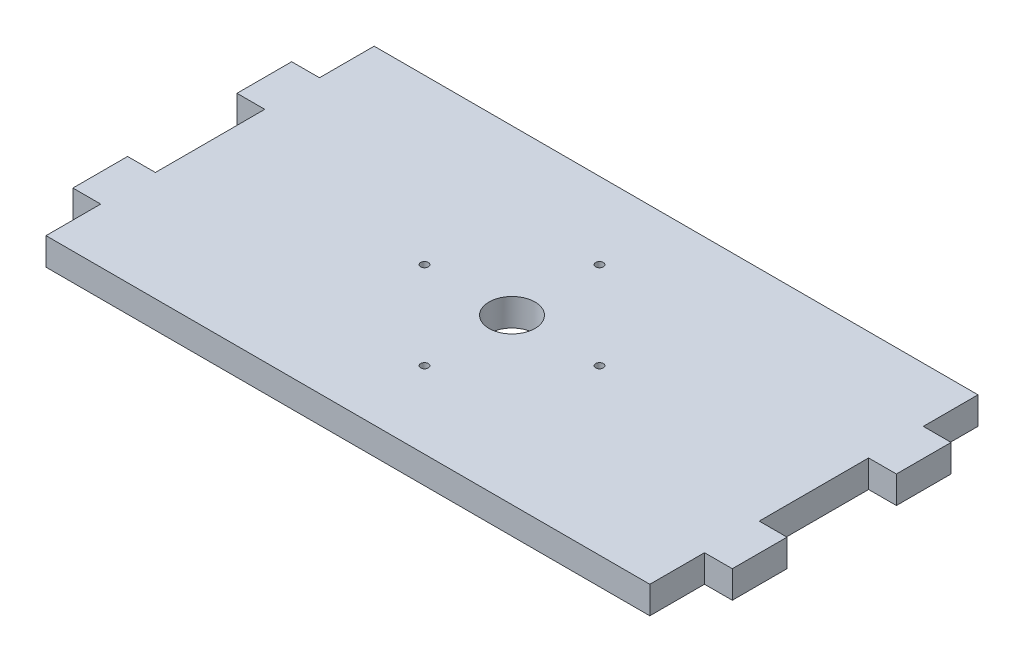
ISO-10303-21;
HEADER;
FILE_DESCRIPTION(('STEP AP214'),'2;1');
FILE_NAME('part.step','',(''),(''),'','','');
FILE_SCHEMA(('AUTOMOTIVE_DESIGN { 1 0 10303 214 1 1 1 1 }'));
ENDSEC;
DATA;
#1=APPLICATION_CONTEXT('core data for automotive mechanical design processes');
#2=APPLICATION_PROTOCOL_DEFINITION('international standard','automotive_design',2000,#1);
#3=PRODUCT_CONTEXT('',#1,'mechanical');
#4=PRODUCT('Part','Part','',(#3));
#5=PRODUCT_RELATED_PRODUCT_CATEGORY('part','',(#4));
#6=PRODUCT_DEFINITION_FORMATION('','',#4);
#7=PRODUCT_DEFINITION_CONTEXT('part definition',#1,'design');
#8=PRODUCT_DEFINITION('design','',#6,#7);
#9=PRODUCT_DEFINITION_SHAPE('','',#8);
#10=(LENGTH_UNIT() NAMED_UNIT(*) SI_UNIT(.MILLI.,.METRE.));
#11=(NAMED_UNIT(*) PLANE_ANGLE_UNIT() SI_UNIT($,.RADIAN.));
#12=(NAMED_UNIT(*) SI_UNIT($,.STERADIAN.) SOLID_ANGLE_UNIT());
#13=UNCERTAINTY_MEASURE_WITH_UNIT(LENGTH_MEASURE(1.E-05),#10,'distance_accuracy_value','');
#14=(GEOMETRIC_REPRESENTATION_CONTEXT(3) GLOBAL_UNCERTAINTY_ASSIGNED_CONTEXT((#13)) GLOBAL_UNIT_ASSIGNED_CONTEXT((#10,
#11,#12)) REPRESENTATION_CONTEXT('',''));
#15=CARTESIAN_POINT('',(0.,0.,0.));
#16=DIRECTION('',(0.,0.,1.));
#17=DIRECTION('',(1.,0.,0.));
#18=AXIS2_PLACEMENT_3D('',#15,#16,#17);
#19=CARTESIAN_POINT('',(-35.052,3.175,19.05));
#20=DIRECTION('',(1.,0.,0.));
#21=DIRECTION('',(0.,0.,-1.));
#22=AXIS2_PLACEMENT_3D('',#19,#20,#21);
#23=PLANE('',#22);
#24=DIRECTION('',(0.,1.,0.));
#25=VECTOR('',#24,1.);
#26=CARTESIAN_POINT('',(-35.052,0.,6.35));
#27=LINE('',#26,#25);
#28=CARTESIAN_POINT('',(-35.052,0.,6.35));
#29=VERTEX_POINT('',#28);
#30=CARTESIAN_POINT('',(-35.052,3.175,6.35));
#31=VERTEX_POINT('',#30);
#32=EDGE_CURVE('E58',#29,#31,#27,.T.);
#33=ORIENTED_EDGE('',*,*,#32,.T.);
#34=DIRECTION('',(0.,0.,1.));
#35=VECTOR('',#34,1.);
#36=CARTESIAN_POINT('',(-35.052,3.175,19.05));
#37=LINE('',#36,#35);
#38=CARTESIAN_POINT('',(-35.052,3.175,-6.35));
#39=VERTEX_POINT('',#38);
#40=EDGE_CURVE('E303',#39,#31,#37,.T.);
#41=ORIENTED_EDGE('',*,*,#40,.F.);
#42=DIRECTION('',(0.,1.,0.));
#43=VECTOR('',#42,1.);
#44=CARTESIAN_POINT('',(-35.052,0.,-6.35));
#45=LINE('',#44,#43);
#46=CARTESIAN_POINT('',(-35.052,0.,-6.35));
#47=VERTEX_POINT('',#46);
#48=EDGE_CURVE('E232',#47,#39,#45,.T.);
#49=ORIENTED_EDGE('',*,*,#48,.F.);
#50=DIRECTION('',(0.,0.,1.));
#51=VECTOR('',#50,1.);
#52=CARTESIAN_POINT('',(-35.052,0.,19.05));
#53=LINE('',#52,#51);
#54=EDGE_CURVE('E250',#47,#29,#53,.T.);
#55=ORIENTED_EDGE('',*,*,#54,.T.);
#56=EDGE_LOOP('',(#33,#41,#49,#55));
#57=FACE_BOUND('',#56,.T.);
#58=ADVANCED_FACE('F33',(#57),#23,.F.);
#59=DIRECTION('',(0.,1.,0.));
#60=VECTOR('',#59,1.);
#61=CARTESIAN_POINT('',(-35.052,0.,12.7));
#62=LINE('',#61,#60);
#63=CARTESIAN_POINT('',(-35.052,0.,12.7));
#64=VERTEX_POINT('',#63);
#65=CARTESIAN_POINT('',(-35.052,3.175,12.7));
#66=VERTEX_POINT('',#65);
#67=EDGE_CURVE('E212',#64,#66,#62,.T.);
#68=ORIENTED_EDGE('',*,*,#67,.F.);
#69=CARTESIAN_POINT('',(-35.052,0.,19.05));
#70=VERTEX_POINT('',#69);
#71=EDGE_CURVE('E247',#64,#70,#53,.T.);
#72=ORIENTED_EDGE('',*,*,#71,.T.);
#73=DIRECTION('',(0.,-1.,0.));
#74=VECTOR('',#73,1.);
#75=CARTESIAN_POINT('',(-35.052,3.175,19.05));
#76=LINE('',#75,#74);
#77=CARTESIAN_POINT('',(-35.052,3.175,19.05));
#78=VERTEX_POINT('',#77);
#79=EDGE_CURVE('E322',#78,#70,#76,.T.);
#80=ORIENTED_EDGE('',*,*,#79,.F.);
#81=EDGE_CURVE('E50',#66,#78,#37,.T.);
#82=ORIENTED_EDGE('',*,*,#81,.F.);
#83=EDGE_LOOP('',(#68,#72,#80,#82));
#84=FACE_BOUND('',#83,.T.);
#85=ADVANCED_FACE('F433',(#84),#23,.F.);
#86=CARTESIAN_POINT('',(35.052,3.175,19.05));
#87=DIRECTION('',(-1.,0.,0.));
#88=DIRECTION('',(0.,0.,1.));
#89=AXIS2_PLACEMENT_3D('',#86,#87,#88);
#90=PLANE('',#89);
#91=DIRECTION('',(0.,0.,-1.));
#92=VECTOR('',#91,1.);
#93=CARTESIAN_POINT('',(35.052,3.175,19.05));
#94=LINE('',#93,#92);
#95=CARTESIAN_POINT('',(35.052,3.175,6.35));
#96=VERTEX_POINT('',#95);
#97=CARTESIAN_POINT('',(35.052,3.175,-6.34999999999998));
#98=VERTEX_POINT('',#97);
#99=EDGE_CURVE('E268',#96,#98,#94,.T.);
#100=ORIENTED_EDGE('',*,*,#99,.F.);
#101=DIRECTION('',(0.,1.,0.));
#102=VECTOR('',#101,1.);
#103=CARTESIAN_POINT('',(35.052,0.,6.35));
#104=LINE('',#103,#102);
#105=CARTESIAN_POINT('',(35.052,0.,6.35));
#106=VERTEX_POINT('',#105);
#107=EDGE_CURVE('E350',#106,#96,#104,.T.);
#108=ORIENTED_EDGE('',*,*,#107,.F.);
#109=DIRECTION('',(0.,0.,-1.));
#110=VECTOR('',#109,1.);
#111=CARTESIAN_POINT('',(35.052,0.,19.05));
#112=LINE('',#111,#110);
#113=CARTESIAN_POINT('',(35.052,0.,-6.35));
#114=VERTEX_POINT('',#113);
#115=EDGE_CURVE('E273',#106,#114,#112,.T.);
#116=ORIENTED_EDGE('',*,*,#115,.T.);
#117=DIRECTION('',(0.,1.,0.));
#118=VECTOR('',#117,1.);
#119=CARTESIAN_POINT('',(35.052,0.,-6.35));
#120=LINE('',#119,#118);
#121=EDGE_CURVE('E379',#114,#98,#120,.T.);
#122=ORIENTED_EDGE('',*,*,#121,.T.);
#123=EDGE_LOOP('',(#100,#108,#116,#122));
#124=FACE_BOUND('',#123,.T.);
#125=ADVANCED_FACE('F416',(#124),#90,.F.);
#126=DIRECTION('',(0.,1.,0.));
#127=VECTOR('',#126,1.);
#128=CARTESIAN_POINT('',(35.052,0.,-12.7));
#129=LINE('',#128,#127);
#130=CARTESIAN_POINT('',(35.052,0.,-12.7));
#131=VERTEX_POINT('',#130);
#132=CARTESIAN_POINT('',(35.052,3.175,-12.7));
#133=VERTEX_POINT('',#132);
#134=EDGE_CURVE('E370',#131,#133,#129,.T.);
#135=ORIENTED_EDGE('',*,*,#134,.F.);
#136=CARTESIAN_POINT('',(35.052,0.,-19.05));
#137=VERTEX_POINT('',#136);
#138=EDGE_CURVE('E288',#131,#137,#112,.T.);
#139=ORIENTED_EDGE('',*,*,#138,.T.);
#140=DIRECTION('',(0.,-1.,0.));
#141=VECTOR('',#140,1.);
#142=CARTESIAN_POINT('',(35.052,3.175,-19.05));
#143=LINE('',#142,#141);
#144=CARTESIAN_POINT('',(35.052,3.175,-19.05));
#145=VERTEX_POINT('',#144);
#146=EDGE_CURVE('E11',#145,#137,#143,.T.);
#147=ORIENTED_EDGE('',*,*,#146,.F.);
#148=EDGE_CURVE('E272',#133,#145,#94,.T.);
#149=ORIENTED_EDGE('',*,*,#148,.F.);
#150=EDGE_LOOP('',(#135,#139,#147,#149));
#151=FACE_BOUND('',#150,.T.);
#152=ADVANCED_FACE('F410',(#151),#90,.F.);
#153=CARTESIAN_POINT('',(35.052,0.,19.05));
#154=VERTEX_POINT('',#153);
#155=CARTESIAN_POINT('',(35.052,0.,12.7));
#156=VERTEX_POINT('',#155);
#157=EDGE_CURVE('E291',#154,#156,#112,.T.);
#158=ORIENTED_EDGE('',*,*,#157,.T.);
#159=DIRECTION('',(0.,1.,0.));
#160=VECTOR('',#159,1.);
#161=CARTESIAN_POINT('',(35.052,0.,12.7));
#162=LINE('',#161,#160);
#163=CARTESIAN_POINT('',(35.052,3.175,12.7));
#164=VERTEX_POINT('',#163);
#165=EDGE_CURVE('E363',#156,#164,#162,.T.);
#166=ORIENTED_EDGE('',*,*,#165,.T.);
#167=CARTESIAN_POINT('',(35.052,3.175,19.05));
#168=VERTEX_POINT('',#167);
#169=EDGE_CURVE('E271',#168,#164,#94,.T.);
#170=ORIENTED_EDGE('',*,*,#169,.F.);
#171=DIRECTION('',(0.,-1.,0.));
#172=VECTOR('',#171,1.);
#173=CARTESIAN_POINT('',(35.052,3.175,19.05));
#174=LINE('',#173,#172);
#175=EDGE_CURVE('E297',#168,#154,#174,.T.);
#176=ORIENTED_EDGE('',*,*,#175,.T.);
#177=EDGE_LOOP('',(#158,#166,#170,#176));
#178=FACE_BOUND('',#177,.T.);
#179=ADVANCED_FACE('F35',(#178),#90,.F.);
#180=CARTESIAN_POINT('',(-35.052,3.175,-19.05));
#181=DIRECTION('',(0.,0.,1.));
#182=DIRECTION('',(1.,0.,0.));
#183=AXIS2_PLACEMENT_3D('',#180,#181,#182);
#184=PLANE('',#183);
#185=DIRECTION('',(-1.,0.,0.));
#186=VECTOR('',#185,1.);
#187=CARTESIAN_POINT('',(-35.052,0.,-19.05));
#188=LINE('',#187,#186);
#189=CARTESIAN_POINT('',(-35.052,0.,-19.05));
#190=VERTEX_POINT('',#189);
#191=EDGE_CURVE('E251',#137,#190,#188,.T.);
#192=ORIENTED_EDGE('',*,*,#191,.T.);
#193=DIRECTION('',(0.,-1.,0.));
#194=VECTOR('',#193,1.);
#195=CARTESIAN_POINT('',(-35.052,3.175,-19.05));
#196=LINE('',#195,#194);
#197=CARTESIAN_POINT('',(-35.052,3.175,-19.05));
#198=VERTEX_POINT('',#197);
#199=EDGE_CURVE('E42',#198,#190,#196,.T.);
#200=ORIENTED_EDGE('',*,*,#199,.F.);
#201=DIRECTION('',(-1.,0.,0.));
#202=VECTOR('',#201,1.);
#203=CARTESIAN_POINT('',(-35.052,3.175,-19.05));
#204=LINE('',#203,#202);
#205=EDGE_CURVE('E280',#145,#198,#204,.T.);
#206=ORIENTED_EDGE('',*,*,#205,.F.);
#207=ORIENTED_EDGE('',*,*,#146,.T.);
#208=EDGE_LOOP('',(#192,#200,#206,#207));
#209=FACE_BOUND('',#208,.T.);
#210=ADVANCED_FACE('F318',(#209),#184,.F.);
#211=CARTESIAN_POINT('',(-35.052,0.,-12.7));
#212=VERTEX_POINT('',#211);
#213=EDGE_CURVE('E265',#190,#212,#53,.T.);
#214=ORIENTED_EDGE('',*,*,#213,.T.);
#215=DIRECTION('',(0.,1.,0.));
#216=VECTOR('',#215,1.);
#217=CARTESIAN_POINT('',(-35.052,0.,-12.7));
#218=LINE('',#217,#216);
#219=CARTESIAN_POINT('',(-35.052,3.175,-12.7));
#220=VERTEX_POINT('',#219);
#221=EDGE_CURVE('E227',#212,#220,#218,.T.);
#222=ORIENTED_EDGE('',*,*,#221,.T.);
#223=EDGE_CURVE('E298',#198,#220,#37,.T.);
#224=ORIENTED_EDGE('',*,*,#223,.F.);
#225=ORIENTED_EDGE('',*,*,#199,.T.);
#226=EDGE_LOOP('',(#214,#222,#224,#225));
#227=FACE_BOUND('',#226,.T.);
#228=ADVANCED_FACE('F324',(#227),#23,.F.);
#229=CARTESIAN_POINT('',(-35.052,3.175,19.05));
#230=DIRECTION('',(0.,0.,-1.));
#231=DIRECTION('',(-1.,0.,0.));
#232=AXIS2_PLACEMENT_3D('',#229,#230,#231);
#233=PLANE('',#232);
#234=DIRECTION('',(1.,0.,0.));
#235=VECTOR('',#234,1.);
#236=CARTESIAN_POINT('',(-35.052,0.,19.05));
#237=LINE('',#236,#235);
#238=EDGE_CURVE('E258',#70,#154,#237,.T.);
#239=ORIENTED_EDGE('',*,*,#238,.T.);
#240=ORIENTED_EDGE('',*,*,#175,.F.);
#241=DIRECTION('',(1.,0.,0.));
#242=VECTOR('',#241,1.);
#243=CARTESIAN_POINT('',(-35.052,3.175,19.05));
#244=LINE('',#243,#242);
#245=EDGE_CURVE('E294',#78,#168,#244,.T.);
#246=ORIENTED_EDGE('',*,*,#245,.F.);
#247=ORIENTED_EDGE('',*,*,#79,.T.);
#248=EDGE_LOOP('',(#239,#240,#246,#247));
#249=FACE_BOUND('',#248,.T.);
#250=ADVANCED_FACE('F440',(#249),#233,.F.);
#251=CARTESIAN_POINT('',(35.052,3.175,-19.05));
#252=DIRECTION('',(0.,-1.,0.));
#253=DIRECTION('',(0.,0.,-1.));
#254=AXIS2_PLACEMENT_3D('',#251,#252,#253);
#255=PLANE('',#254);
#256=CARTESIAN_POINT('',(-10.1599999999999,3.175,1.41893801610585E-13));
#257=DIRECTION('',(0.,1.,0.));
#258=DIRECTION('',(0.,0.,1.));
#259=AXIS2_PLACEMENT_3D('',#256,#257,#258);
#260=CIRCLE('',#259,0.4445);
#261=CARTESIAN_POINT('',(-10.1599999999999,3.175,0.444500000000142));
#262=VERTEX_POINT('',#261);
#263=EDGE_CURVE('E653',#262,#262,#260,.T.);
#264=ORIENTED_EDGE('',*,*,#263,.F.);
#265=EDGE_LOOP('',(#264));
#266=FACE_BOUND('',#265,.T.);
#267=CARTESIAN_POINT('',(2.86276085517037E-13,3.175,10.16));
#268=DIRECTION('',(0.,1.,0.));
#269=DIRECTION('',(0.,0.,1.));
#270=AXIS2_PLACEMENT_3D('',#267,#268,#269);
#271=CIRCLE('',#270,0.4445);
#272=CARTESIAN_POINT('',(2.86276085517037E-13,3.175,10.6045));
#273=VERTEX_POINT('',#272);
#274=EDGE_CURVE('E655',#273,#273,#271,.T.);
#275=ORIENTED_EDGE('',*,*,#274,.F.);
#276=EDGE_LOOP('',(#275));
#277=FACE_BOUND('',#276,.T.);
#278=CARTESIAN_POINT('',(10.16,3.175,0.));
#279=DIRECTION('',(0.,1.,0.));
#280=DIRECTION('',(0.,0.,1.));
#281=AXIS2_PLACEMENT_3D('',#278,#279,#280);
#282=CIRCLE('',#281,0.4445);
#283=CARTESIAN_POINT('',(10.16,3.175,0.444500000000035));
#284=VERTEX_POINT('',#283);
#285=EDGE_CURVE('E660',#284,#284,#282,.T.);
#286=ORIENTED_EDGE('',*,*,#285,.F.);
#287=EDGE_LOOP('',(#286));
#288=FACE_BOUND('',#287,.T.);
#289=CARTESIAN_POINT('',(0.,3.175,-10.16));
#290=DIRECTION('',(0.,1.,0.));
#291=DIRECTION('',(0.,0.,1.));
#292=AXIS2_PLACEMENT_3D('',#289,#290,#291);
#293=CIRCLE('',#292,0.4445);
#294=CARTESIAN_POINT('',(0.,3.175,-9.7155));
#295=VERTEX_POINT('',#294);
#296=EDGE_CURVE('E663',#295,#295,#293,.T.);
#297=ORIENTED_EDGE('',*,*,#296,.F.);
#298=EDGE_LOOP('',(#297));
#299=FACE_BOUND('',#298,.T.);
#300=CARTESIAN_POINT('',(0.,3.175,0.));
#301=DIRECTION('',(0.,1.,0.));
#302=DIRECTION('',(0.,0.,1.));
#303=AXIS2_PLACEMENT_3D('',#300,#301,#302);
#304=CIRCLE('',#303,2.667);
#305=CARTESIAN_POINT('',(0.,3.175,2.667));
#306=VERTEX_POINT('',#305);
#307=EDGE_CURVE('E202',#306,#306,#304,.T.);
#308=ORIENTED_EDGE('',*,*,#307,.F.);
#309=EDGE_LOOP('',(#308));
#310=FACE_BOUND('',#309,.T.);
#311=ORIENTED_EDGE('',*,*,#169,.T.);
#312=DIRECTION('',(1.,0.,0.));
#313=VECTOR('',#312,1.);
#314=CARTESIAN_POINT('',(35.052,3.175,12.7));
#315=LINE('',#314,#313);
#316=CARTESIAN_POINT('',(38.2778,3.175,12.7));
#317=VERTEX_POINT('',#316);
#318=EDGE_CURVE('E353',#164,#317,#315,.T.);
#319=ORIENTED_EDGE('',*,*,#318,.T.);
#320=DIRECTION('',(0.,0.,-1.));
#321=VECTOR('',#320,1.);
#322=CARTESIAN_POINT('',(38.2778,3.175,6.35));
#323=LINE('',#322,#321);
#324=CARTESIAN_POINT('',(38.2778,3.175,6.35));
#325=VERTEX_POINT('',#324);
#326=EDGE_CURVE('E344',#317,#325,#323,.T.);
#327=ORIENTED_EDGE('',*,*,#326,.T.);
#328=DIRECTION('',(-1.,0.,0.));
#329=VECTOR('',#328,1.);
#330=CARTESIAN_POINT('',(35.052,3.175,6.35));
#331=LINE('',#330,#329);
#332=EDGE_CURVE('E231',#325,#96,#331,.T.);
#333=ORIENTED_EDGE('',*,*,#332,.T.);
#334=ORIENTED_EDGE('',*,*,#99,.T.);
#335=DIRECTION('',(1.,0.,0.));
#336=VECTOR('',#335,1.);
#337=CARTESIAN_POINT('',(35.052,3.175,-6.35));
#338=LINE('',#337,#336);
#339=CARTESIAN_POINT('',(38.2778,3.175,-6.35));
#340=VERTEX_POINT('',#339);
#341=EDGE_CURVE('E376',#98,#340,#338,.T.);
#342=ORIENTED_EDGE('',*,*,#341,.T.);
#343=DIRECTION('',(0.,0.,-1.));
#344=VECTOR('',#343,1.);
#345=CARTESIAN_POINT('',(38.2778,3.175,-12.7));
#346=LINE('',#345,#344);
#347=CARTESIAN_POINT('',(38.2778,3.175,-12.7));
#348=VERTEX_POINT('',#347);
#349=EDGE_CURVE('E372',#340,#348,#346,.T.);
#350=ORIENTED_EDGE('',*,*,#349,.T.);
#351=DIRECTION('',(-1.,0.,0.));
#352=VECTOR('',#351,1.);
#353=CARTESIAN_POINT('',(35.052,3.175,-12.7));
#354=LINE('',#353,#352);
#355=EDGE_CURVE('E360',#348,#133,#354,.T.);
#356=ORIENTED_EDGE('',*,*,#355,.T.);
#357=ORIENTED_EDGE('',*,*,#148,.T.);
#358=ORIENTED_EDGE('',*,*,#205,.T.);
#359=ORIENTED_EDGE('',*,*,#223,.T.);
#360=DIRECTION('',(1.,0.,0.));
#361=VECTOR('',#360,1.);
#362=CARTESIAN_POINT('',(-35.052,3.175,-12.7));
#363=LINE('',#362,#361);
#364=CARTESIAN_POINT('',(-38.2778,3.175,-12.7));
#365=VERTEX_POINT('',#364);
#366=EDGE_CURVE('E211',#365,#220,#363,.T.);
#367=ORIENTED_EDGE('',*,*,#366,.F.);
#368=DIRECTION('',(0.,0.,-1.));
#369=VECTOR('',#368,1.);
#370=CARTESIAN_POINT('',(-38.2778,3.175,-12.7));
#371=LINE('',#370,#369);
#372=CARTESIAN_POINT('',(-38.2778,3.175,-6.35));
#373=VERTEX_POINT('',#372);
#374=EDGE_CURVE('E219',#373,#365,#371,.T.);
#375=ORIENTED_EDGE('',*,*,#374,.F.);
#376=DIRECTION('',(-1.,0.,0.));
#377=VECTOR('',#376,1.);
#378=CARTESIAN_POINT('',(-35.052,3.175,-6.35));
#379=LINE('',#378,#377);
#380=EDGE_CURVE('E221',#39,#373,#379,.T.);
#381=ORIENTED_EDGE('',*,*,#380,.F.);
#382=ORIENTED_EDGE('',*,*,#40,.T.);
#383=DIRECTION('',(1.,0.,0.));
#384=VECTOR('',#383,1.);
#385=CARTESIAN_POINT('',(-35.052,3.175,6.35));
#386=LINE('',#385,#384);
#387=CARTESIAN_POINT('',(-38.2778,3.175,6.35));
#388=VERTEX_POINT('',#387);
#389=EDGE_CURVE('E206',#388,#31,#386,.T.);
#390=ORIENTED_EDGE('',*,*,#389,.F.);
#391=DIRECTION('',(0.,0.,-1.));
#392=VECTOR('',#391,1.);
#393=CARTESIAN_POINT('',(-38.2778,3.175,6.35));
#394=LINE('',#393,#392);
#395=CARTESIAN_POINT('',(-38.2778,3.175,12.7));
#396=VERTEX_POINT('',#395);
#397=EDGE_CURVE('E191',#396,#388,#394,.T.);
#398=ORIENTED_EDGE('',*,*,#397,.F.);
#399=DIRECTION('',(-1.,0.,0.));
#400=VECTOR('',#399,1.);
#401=CARTESIAN_POINT('',(-35.052,3.175,12.7));
#402=LINE('',#401,#400);
#403=EDGE_CURVE('E198',#66,#396,#402,.T.);
#404=ORIENTED_EDGE('',*,*,#403,.F.);
#405=ORIENTED_EDGE('',*,*,#81,.T.);
#406=ORIENTED_EDGE('',*,*,#245,.T.);
#407=EDGE_LOOP('',(#311,#319,#327,#333,#334,#342,#350,#356,#357,#358,#359,#367,#375,#381,#382,
#390,#398,#404,#405,#406));
#408=FACE_BOUND('',#407,.T.);
#409=ADVANCED_FACE('F312',(#266,#277,#288,#299,#310,#408),#255,.F.);
#410=CARTESIAN_POINT('',(35.052,0.,-19.05));
#411=DIRECTION('',(0.,-1.,0.));
#412=DIRECTION('',(0.,0.,-1.));
#413=AXIS2_PLACEMENT_3D('',#410,#411,#412);
#414=PLANE('',#413);
#415=CARTESIAN_POINT('',(-10.1599999999999,0.,1.41893801610585E-13));
#416=DIRECTION('',(0.,-1.,0.));
#417=DIRECTION('',(0.,0.,-1.));
#418=AXIS2_PLACEMENT_3D('',#415,#416,#417);
#419=CIRCLE('',#418,0.4445);
#420=CARTESIAN_POINT('',(-10.1599999999999,0.,-0.444499999999858));
#421=VERTEX_POINT('',#420);
#422=EDGE_CURVE('E37',#421,#421,#419,.T.);
#423=ORIENTED_EDGE('',*,*,#422,.F.);
#424=EDGE_LOOP('',(#423));
#425=FACE_BOUND('',#424,.T.);
#426=CARTESIAN_POINT('',(2.86276085517037E-13,0.,10.16));
#427=DIRECTION('',(0.,-1.,0.));
#428=DIRECTION('',(0.,0.,-1.));
#429=AXIS2_PLACEMENT_3D('',#426,#427,#428);
#430=CIRCLE('',#429,0.4445);
#431=CARTESIAN_POINT('',(2.86276085517037E-13,0.,9.7155));
#432=VERTEX_POINT('',#431);
#433=EDGE_CURVE('E659',#432,#432,#430,.T.);
#434=ORIENTED_EDGE('',*,*,#433,.F.);
#435=EDGE_LOOP('',(#434));
#436=FACE_BOUND('',#435,.T.);
#437=CARTESIAN_POINT('',(10.16,0.,0.));
#438=DIRECTION('',(0.,-1.,0.));
#439=DIRECTION('',(0.,0.,-1.));
#440=AXIS2_PLACEMENT_3D('',#437,#438,#439);
#441=CIRCLE('',#440,0.4445);
#442=CARTESIAN_POINT('',(10.16,0.,-0.444499999999965));
#443=VERTEX_POINT('',#442);
#444=EDGE_CURVE('E662',#443,#443,#441,.T.);
#445=ORIENTED_EDGE('',*,*,#444,.F.);
#446=EDGE_LOOP('',(#445));
#447=FACE_BOUND('',#446,.T.);
#448=CARTESIAN_POINT('',(0.,0.,-10.16));
#449=DIRECTION('',(0.,-1.,0.));
#450=DIRECTION('',(0.,0.,-1.));
#451=AXIS2_PLACEMENT_3D('',#448,#449,#450);
#452=CIRCLE('',#451,0.4445);
#453=CARTESIAN_POINT('',(0.,0.,-10.6045));
#454=VERTEX_POINT('',#453);
#455=EDGE_CURVE('E665',#454,#454,#452,.T.);
#456=ORIENTED_EDGE('',*,*,#455,.F.);
#457=EDGE_LOOP('',(#456));
#458=FACE_BOUND('',#457,.T.);
#459=CARTESIAN_POINT('',(0.,0.,0.));
#460=DIRECTION('',(0.,-1.,0.));
#461=DIRECTION('',(0.,0.,-1.));
#462=AXIS2_PLACEMENT_3D('',#459,#460,#461);
#463=CIRCLE('',#462,2.667);
#464=CARTESIAN_POINT('',(0.,0.,-2.667));
#465=VERTEX_POINT('',#464);
#466=EDGE_CURVE('E208',#465,#465,#463,.T.);
#467=ORIENTED_EDGE('',*,*,#466,.F.);
#468=EDGE_LOOP('',(#467));
#469=FACE_BOUND('',#468,.T.);
#470=ORIENTED_EDGE('',*,*,#157,.F.);
#471=ORIENTED_EDGE('',*,*,#238,.F.);
#472=ORIENTED_EDGE('',*,*,#71,.F.);
#473=DIRECTION('',(-1.,0.,0.));
#474=VECTOR('',#473,1.);
#475=CARTESIAN_POINT('',(-35.052,0.,12.7));
#476=LINE('',#475,#474);
#477=CARTESIAN_POINT('',(-38.2778,0.,12.7));
#478=VERTEX_POINT('',#477);
#479=EDGE_CURVE('E182',#64,#478,#476,.T.);
#480=ORIENTED_EDGE('',*,*,#479,.T.);
#481=DIRECTION('',(0.,0.,-1.));
#482=VECTOR('',#481,1.);
#483=CARTESIAN_POINT('',(-38.2778,0.,6.35));
#484=LINE('',#483,#482);
#485=CARTESIAN_POINT('',(-38.2778,0.,6.35));
#486=VERTEX_POINT('',#485);
#487=EDGE_CURVE('E174',#478,#486,#484,.T.);
#488=ORIENTED_EDGE('',*,*,#487,.T.);
#489=DIRECTION('',(1.,0.,0.));
#490=VECTOR('',#489,1.);
#491=CARTESIAN_POINT('',(-35.052,0.,6.35));
#492=LINE('',#491,#490);
#493=EDGE_CURVE('E180',#486,#29,#492,.T.);
#494=ORIENTED_EDGE('',*,*,#493,.T.);
#495=ORIENTED_EDGE('',*,*,#54,.F.);
#496=DIRECTION('',(-1.,0.,0.));
#497=VECTOR('',#496,1.);
#498=CARTESIAN_POINT('',(-35.052,0.,-6.35));
#499=LINE('',#498,#497);
#500=CARTESIAN_POINT('',(-38.2778,0.,-6.35));
#501=VERTEX_POINT('',#500);
#502=EDGE_CURVE('E217',#47,#501,#499,.T.);
#503=ORIENTED_EDGE('',*,*,#502,.T.);
#504=DIRECTION('',(0.,0.,-1.));
#505=VECTOR('',#504,1.);
#506=CARTESIAN_POINT('',(-38.2778,0.,-12.7));
#507=LINE('',#506,#505);
#508=CARTESIAN_POINT('',(-38.2778,0.,-12.7));
#509=VERTEX_POINT('',#508);
#510=EDGE_CURVE('E215',#501,#509,#507,.T.);
#511=ORIENTED_EDGE('',*,*,#510,.T.);
#512=DIRECTION('',(1.,0.,0.));
#513=VECTOR('',#512,1.);
#514=CARTESIAN_POINT('',(-35.052,0.,-12.7));
#515=LINE('',#514,#513);
#516=EDGE_CURVE('E218',#509,#212,#515,.T.);
#517=ORIENTED_EDGE('',*,*,#516,.T.);
#518=ORIENTED_EDGE('',*,*,#213,.F.);
#519=ORIENTED_EDGE('',*,*,#191,.F.);
#520=ORIENTED_EDGE('',*,*,#138,.F.);
#521=DIRECTION('',(-1.,0.,0.));
#522=VECTOR('',#521,1.);
#523=CARTESIAN_POINT('',(35.052,0.,-12.7));
#524=LINE('',#523,#522);
#525=CARTESIAN_POINT('',(38.2778,0.,-12.7));
#526=VERTEX_POINT('',#525);
#527=EDGE_CURVE('E375',#526,#131,#524,.T.);
#528=ORIENTED_EDGE('',*,*,#527,.F.);
#529=DIRECTION('',(0.,0.,-1.));
#530=VECTOR('',#529,1.);
#531=CARTESIAN_POINT('',(38.2778,0.,-12.7));
#532=LINE('',#531,#530);
#533=CARTESIAN_POINT('',(38.2778,0.,-6.35));
#534=VERTEX_POINT('',#533);
#535=EDGE_CURVE('E367',#534,#526,#532,.T.);
#536=ORIENTED_EDGE('',*,*,#535,.F.);
#537=DIRECTION('',(1.,0.,0.));
#538=VECTOR('',#537,1.);
#539=CARTESIAN_POINT('',(35.052,0.,-6.35));
#540=LINE('',#539,#538);
#541=EDGE_CURVE('E371',#114,#534,#540,.T.);
#542=ORIENTED_EDGE('',*,*,#541,.F.);
#543=ORIENTED_EDGE('',*,*,#115,.F.);
#544=DIRECTION('',(-1.,0.,0.));
#545=VECTOR('',#544,1.);
#546=CARTESIAN_POINT('',(35.052,0.,6.35));
#547=LINE('',#546,#545);
#548=CARTESIAN_POINT('',(38.2778,0.,6.35));
#549=VERTEX_POINT('',#548);
#550=EDGE_CURVE('E340',#549,#106,#547,.T.);
#551=ORIENTED_EDGE('',*,*,#550,.F.);
#552=DIRECTION('',(0.,0.,-1.));
#553=VECTOR('',#552,1.);
#554=CARTESIAN_POINT('',(38.2778,0.,6.35));
#555=LINE('',#554,#553);
#556=CARTESIAN_POINT('',(38.2778,0.,12.7));
#557=VERTEX_POINT('',#556);
#558=EDGE_CURVE('E347',#557,#549,#555,.T.);
#559=ORIENTED_EDGE('',*,*,#558,.F.);
#560=DIRECTION('',(1.,0.,0.));
#561=VECTOR('',#560,1.);
#562=CARTESIAN_POINT('',(35.052,0.,12.7));
#563=LINE('',#562,#561);
#564=EDGE_CURVE('E343',#156,#557,#563,.T.);
#565=ORIENTED_EDGE('',*,*,#564,.F.);
#566=EDGE_LOOP('',(#470,#471,#472,#480,#488,#494,#495,#503,#511,#517,#518,#519,#520,#528,#536,
#542,#543,#551,#559,#565));
#567=FACE_BOUND('',#566,.T.);
#568=ADVANCED_FACE('F177',(#425,#436,#447,#458,#469,#567),#414,.T.);
#569=CARTESIAN_POINT('',(35.052,0.,-12.7));
#570=DIRECTION('',(0.,0.,-1.));
#571=DIRECTION('',(-1.,0.,0.));
#572=AXIS2_PLACEMENT_3D('',#569,#570,#571);
#573=PLANE('',#572);
#574=ORIENTED_EDGE('',*,*,#355,.F.);
#575=DIRECTION('',(0.,1.,0.));
#576=VECTOR('',#575,1.);
#577=CARTESIAN_POINT('',(38.2778,0.,-12.7));
#578=LINE('',#577,#576);
#579=EDGE_CURVE('E290',#526,#348,#578,.T.);
#580=ORIENTED_EDGE('',*,*,#579,.F.);
#581=ORIENTED_EDGE('',*,*,#527,.T.);
#582=ORIENTED_EDGE('',*,*,#134,.T.);
#583=EDGE_LOOP('',(#574,#580,#581,#582));
#584=FACE_BOUND('',#583,.T.);
#585=ADVANCED_FACE('F406',(#584),#573,.T.);
#586=CARTESIAN_POINT('',(38.2778,0.,-12.7));
#587=DIRECTION('',(1.,0.,0.));
#588=DIRECTION('',(0.,0.,-1.));
#589=AXIS2_PLACEMENT_3D('',#586,#587,#588);
#590=PLANE('',#589);
#591=ORIENTED_EDGE('',*,*,#349,.F.);
#592=DIRECTION('',(0.,1.,0.));
#593=VECTOR('',#592,1.);
#594=CARTESIAN_POINT('',(38.2778,0.,-6.35));
#595=LINE('',#594,#593);
#596=EDGE_CURVE('E378',#534,#340,#595,.T.);
#597=ORIENTED_EDGE('',*,*,#596,.F.);
#598=ORIENTED_EDGE('',*,*,#535,.T.);
#599=ORIENTED_EDGE('',*,*,#579,.T.);
#600=EDGE_LOOP('',(#591,#597,#598,#599));
#601=FACE_BOUND('',#600,.T.);
#602=ADVANCED_FACE('F402',(#601),#590,.T.);
#603=CARTESIAN_POINT('',(35.052,0.,-6.35));
#604=DIRECTION('',(0.,0.,1.));
#605=DIRECTION('',(1.,0.,0.));
#606=AXIS2_PLACEMENT_3D('',#603,#604,#605);
#607=PLANE('',#606);
#608=ORIENTED_EDGE('',*,*,#341,.F.);
#609=ORIENTED_EDGE('',*,*,#121,.F.);
#610=ORIENTED_EDGE('',*,*,#541,.T.);
#611=ORIENTED_EDGE('',*,*,#596,.T.);
#612=EDGE_LOOP('',(#608,#609,#610,#611));
#613=FACE_BOUND('',#612,.T.);
#614=ADVANCED_FACE('F419',(#613),#607,.T.);
#615=CARTESIAN_POINT('',(35.052,0.,6.35));
#616=DIRECTION('',(0.,0.,-1.));
#617=DIRECTION('',(-1.,0.,0.));
#618=AXIS2_PLACEMENT_3D('',#615,#616,#617);
#619=PLANE('',#618);
#620=ORIENTED_EDGE('',*,*,#332,.F.);
#621=DIRECTION('',(0.,1.,0.));
#622=VECTOR('',#621,1.);
#623=CARTESIAN_POINT('',(38.2778,0.,6.35));
#624=LINE('',#623,#622);
#625=EDGE_CURVE('E358',#549,#325,#624,.T.);
#626=ORIENTED_EDGE('',*,*,#625,.F.);
#627=ORIENTED_EDGE('',*,*,#550,.T.);
#628=ORIENTED_EDGE('',*,*,#107,.T.);
#629=EDGE_LOOP('',(#620,#626,#627,#628));
#630=FACE_BOUND('',#629,.T.);
#631=ADVANCED_FACE('F421',(#630),#619,.T.);
#632=CARTESIAN_POINT('',(38.2778,0.,6.35));
#633=DIRECTION('',(1.,0.,0.));
#634=DIRECTION('',(0.,0.,-1.));
#635=AXIS2_PLACEMENT_3D('',#632,#633,#634);
#636=PLANE('',#635);
#637=ORIENTED_EDGE('',*,*,#326,.F.);
#638=DIRECTION('',(0.,1.,0.));
#639=VECTOR('',#638,1.);
#640=CARTESIAN_POINT('',(38.2778,0.,12.7));
#641=LINE('',#640,#639);
#642=EDGE_CURVE('E361',#557,#317,#641,.T.);
#643=ORIENTED_EDGE('',*,*,#642,.F.);
#644=ORIENTED_EDGE('',*,*,#558,.T.);
#645=ORIENTED_EDGE('',*,*,#625,.T.);
#646=EDGE_LOOP('',(#637,#643,#644,#645));
#647=FACE_BOUND('',#646,.T.);
#648=ADVANCED_FACE('F427',(#647),#636,.T.);
#649=CARTESIAN_POINT('',(35.052,0.,12.7));
#650=DIRECTION('',(0.,0.,1.));
#651=DIRECTION('',(1.,0.,0.));
#652=AXIS2_PLACEMENT_3D('',#649,#650,#651);
#653=PLANE('',#652);
#654=ORIENTED_EDGE('',*,*,#318,.F.);
#655=ORIENTED_EDGE('',*,*,#165,.F.);
#656=ORIENTED_EDGE('',*,*,#564,.T.);
#657=ORIENTED_EDGE('',*,*,#642,.T.);
#658=EDGE_LOOP('',(#654,#655,#656,#657));
#659=FACE_BOUND('',#658,.T.);
#660=ADVANCED_FACE('F502',(#659),#653,.T.);
#661=CARTESIAN_POINT('',(-35.052,0.,-12.7));
#662=DIRECTION('',(0.,0.,1.));
#663=DIRECTION('',(1.,0.,0.));
#664=AXIS2_PLACEMENT_3D('',#661,#662,#663);
#665=PLANE('',#664);
#666=ORIENTED_EDGE('',*,*,#366,.T.);
#667=ORIENTED_EDGE('',*,*,#221,.F.);
#668=ORIENTED_EDGE('',*,*,#516,.F.);
#669=DIRECTION('',(0.,1.,0.));
#670=VECTOR('',#669,1.);
#671=CARTESIAN_POINT('',(-38.2778,0.,-12.7));
#672=LINE('',#671,#670);
#673=EDGE_CURVE('E241',#509,#365,#672,.T.);
#674=ORIENTED_EDGE('',*,*,#673,.T.);
#675=EDGE_LOOP('',(#666,#667,#668,#674));
#676=FACE_BOUND('',#675,.T.);
#677=ADVANCED_FACE('F328',(#676),#665,.F.);
#678=CARTESIAN_POINT('',(-35.052,0.,-6.35));
#679=DIRECTION('',(0.,0.,-1.));
#680=DIRECTION('',(-1.,0.,0.));
#681=AXIS2_PLACEMENT_3D('',#678,#679,#680);
#682=PLANE('',#681);
#683=ORIENTED_EDGE('',*,*,#380,.T.);
#684=DIRECTION('',(0.,1.,0.));
#685=VECTOR('',#684,1.);
#686=CARTESIAN_POINT('',(-38.2778,0.,-6.35));
#687=LINE('',#686,#685);
#688=EDGE_CURVE('E239',#501,#373,#687,.T.);
#689=ORIENTED_EDGE('',*,*,#688,.F.);
#690=ORIENTED_EDGE('',*,*,#502,.F.);
#691=ORIENTED_EDGE('',*,*,#48,.T.);
#692=EDGE_LOOP('',(#683,#689,#690,#691));
#693=FACE_BOUND('',#692,.T.);
#694=ADVANCED_FACE('F535',(#693),#682,.F.);
#695=CARTESIAN_POINT('',(-38.2778,0.,-12.7));
#696=DIRECTION('',(1.,0.,0.));
#697=DIRECTION('',(0.,0.,-1.));
#698=AXIS2_PLACEMENT_3D('',#695,#696,#697);
#699=PLANE('',#698);
#700=ORIENTED_EDGE('',*,*,#374,.T.);
#701=ORIENTED_EDGE('',*,*,#673,.F.);
#702=ORIENTED_EDGE('',*,*,#510,.F.);
#703=ORIENTED_EDGE('',*,*,#688,.T.);
#704=EDGE_LOOP('',(#700,#701,#702,#703));
#705=FACE_BOUND('',#704,.T.);
#706=ADVANCED_FACE('F334',(#705),#699,.F.);
#707=CARTESIAN_POINT('',(-35.052,0.,6.35));
#708=DIRECTION('',(0.,0.,1.));
#709=DIRECTION('',(1.,0.,0.));
#710=AXIS2_PLACEMENT_3D('',#707,#708,#709);
#711=PLANE('',#710);
#712=ORIENTED_EDGE('',*,*,#389,.T.);
#713=ORIENTED_EDGE('',*,*,#32,.F.);
#714=ORIENTED_EDGE('',*,*,#493,.F.);
#715=DIRECTION('',(0.,1.,0.));
#716=VECTOR('',#715,1.);
#717=CARTESIAN_POINT('',(-38.2778,0.,6.35));
#718=LINE('',#717,#716);
#719=EDGE_CURVE('E188',#486,#388,#718,.T.);
#720=ORIENTED_EDGE('',*,*,#719,.T.);
#721=EDGE_LOOP('',(#712,#713,#714,#720));
#722=FACE_BOUND('',#721,.T.);
#723=ADVANCED_FACE('F197',(#722),#711,.F.);
#724=CARTESIAN_POINT('',(-35.052,0.,12.7));
#725=DIRECTION('',(0.,0.,-1.));
#726=DIRECTION('',(-1.,0.,0.));
#727=AXIS2_PLACEMENT_3D('',#724,#725,#726);
#728=PLANE('',#727);
#729=ORIENTED_EDGE('',*,*,#403,.T.);
#730=DIRECTION('',(0.,1.,0.));
#731=VECTOR('',#730,1.);
#732=CARTESIAN_POINT('',(-38.2778,0.,12.7));
#733=LINE('',#732,#731);
#734=EDGE_CURVE('E195',#478,#396,#733,.T.);
#735=ORIENTED_EDGE('',*,*,#734,.F.);
#736=ORIENTED_EDGE('',*,*,#479,.F.);
#737=ORIENTED_EDGE('',*,*,#67,.T.);
#738=EDGE_LOOP('',(#729,#735,#736,#737));
#739=FACE_BOUND('',#738,.T.);
#740=ADVANCED_FACE('F561',(#739),#728,.F.);
#741=CARTESIAN_POINT('',(-38.2778,0.,6.35));
#742=DIRECTION('',(1.,0.,0.));
#743=DIRECTION('',(0.,0.,-1.));
#744=AXIS2_PLACEMENT_3D('',#741,#742,#743);
#745=PLANE('',#744);
#746=ORIENTED_EDGE('',*,*,#397,.T.);
#747=ORIENTED_EDGE('',*,*,#719,.F.);
#748=ORIENTED_EDGE('',*,*,#487,.F.);
#749=ORIENTED_EDGE('',*,*,#734,.T.);
#750=EDGE_LOOP('',(#746,#747,#748,#749));
#751=FACE_BOUND('',#750,.T.);
#752=ADVANCED_FACE('F189',(#751),#745,.F.);
#753=CARTESIAN_POINT('',(0.,-5.00000000001367E-05,0.));
#754=DIRECTION('',(0.,1.,0.));
#755=DIRECTION('',(0.,0.,1.));
#756=AXIS2_PLACEMENT_3D('',#753,#754,#755);
#757=CYLINDRICAL_SURFACE('',#756,2.667);
#758=ORIENTED_EDGE('',*,*,#466,.T.);
#759=EDGE_LOOP('',(#758));
#760=FACE_BOUND('',#759,.T.);
#761=ORIENTED_EDGE('',*,*,#307,.T.);
#762=EDGE_LOOP('',(#761));
#763=FACE_BOUND('',#762,.T.);
#764=ADVANCED_FACE('F579',(#760,#763),#757,.F.);
#765=CARTESIAN_POINT('',(0.,-5.00000000001367E-05,-10.16));
#766=DIRECTION('',(0.,1.,0.));
#767=DIRECTION('',(0.,0.,1.));
#768=AXIS2_PLACEMENT_3D('',#765,#766,#767);
#769=CYLINDRICAL_SURFACE('',#768,0.4445);
#770=ORIENTED_EDGE('',*,*,#455,.T.);
#771=EDGE_LOOP('',(#770));
#772=FACE_BOUND('',#771,.T.);
#773=ORIENTED_EDGE('',*,*,#296,.T.);
#774=EDGE_LOOP('',(#773));
#775=FACE_BOUND('',#774,.T.);
#776=ADVANCED_FACE('F604',(#772,#775),#769,.F.);
#777=CARTESIAN_POINT('',(10.16,-5.00000000001367E-05,0.));
#778=DIRECTION('',(0.,1.,0.));
#779=DIRECTION('',(0.,0.,1.));
#780=AXIS2_PLACEMENT_3D('',#777,#778,#779);
#781=CYLINDRICAL_SURFACE('',#780,0.4445);
#782=ORIENTED_EDGE('',*,*,#444,.T.);
#783=EDGE_LOOP('',(#782));
#784=FACE_BOUND('',#783,.T.);
#785=ORIENTED_EDGE('',*,*,#285,.T.);
#786=EDGE_LOOP('',(#785));
#787=FACE_BOUND('',#786,.T.);
#788=ADVANCED_FACE('F614',(#784,#787),#781,.F.);
#789=CARTESIAN_POINT('',(2.86276085517037E-13,-5.00000000001367E-05,10.16));
#790=DIRECTION('',(0.,1.,0.));
#791=DIRECTION('',(0.,0.,1.));
#792=AXIS2_PLACEMENT_3D('',#789,#790,#791);
#793=CYLINDRICAL_SURFACE('',#792,0.4445);
#794=ORIENTED_EDGE('',*,*,#433,.T.);
#795=EDGE_LOOP('',(#794));
#796=FACE_BOUND('',#795,.T.);
#797=ORIENTED_EDGE('',*,*,#274,.T.);
#798=EDGE_LOOP('',(#797));
#799=FACE_BOUND('',#798,.T.);
#800=ADVANCED_FACE('F624',(#796,#799),#793,.F.);
#801=CARTESIAN_POINT('',(-10.1599999999999,-5.00000000001367E-05,1.41893801610585E-13));
#802=DIRECTION('',(0.,1.,0.));
#803=DIRECTION('',(0.,0.,1.));
#804=AXIS2_PLACEMENT_3D('',#801,#802,#803);
#805=CYLINDRICAL_SURFACE('',#804,0.4445);
#806=ORIENTED_EDGE('',*,*,#422,.T.);
#807=EDGE_LOOP('',(#806));
#808=FACE_BOUND('',#807,.T.);
#809=ORIENTED_EDGE('',*,*,#263,.T.);
#810=EDGE_LOOP('',(#809));
#811=FACE_BOUND('',#810,.T.);
#812=ADVANCED_FACE('F634',(#808,#811),#805,.F.);
#813=CLOSED_SHELL('',(#58,#85,#125,#152,#179,#210,#228,#250,#409,#568,#585,#602,#614,#631,#648,
#660,#677,#694,#706,#723,#740,#752,#764,#776,#788,#800,#812));
#814=MANIFOLD_SOLID_BREP('B2',#813);
#815=ADVANCED_BREP_SHAPE_REPRESENTATION('',(#18,#814),#14);
#816=SHAPE_DEFINITION_REPRESENTATION(#9,#815);
ENDSEC;
END-ISO-10303-21;
